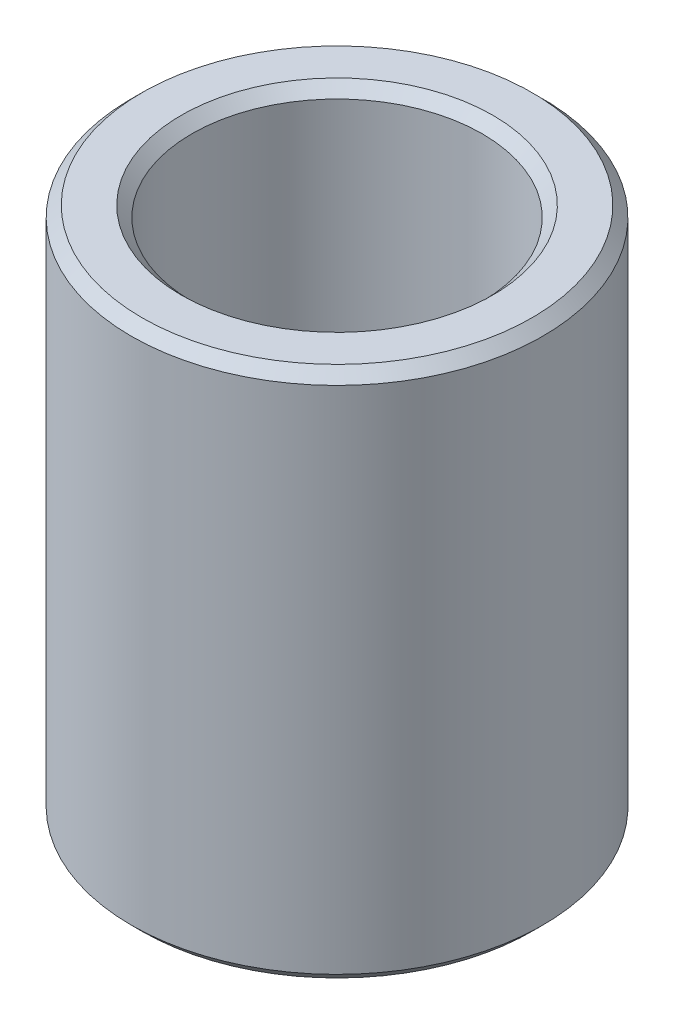
ISO-10303-21;
HEADER;
FILE_DESCRIPTION(('STEP AP214'),'2;1');
FILE_NAME('part.step','',(''),(''),'','','');
FILE_SCHEMA(('AUTOMOTIVE_DESIGN { 1 0 10303 214 1 1 1 1 }'));
ENDSEC;
DATA;
#1=APPLICATION_CONTEXT('core data for automotive mechanical design processes');
#2=APPLICATION_PROTOCOL_DEFINITION('international standard','automotive_design',2000,#1);
#3=PRODUCT_CONTEXT('',#1,'mechanical');
#4=PRODUCT('Part','Part','',(#3));
#5=PRODUCT_RELATED_PRODUCT_CATEGORY('part','',(#4));
#6=PRODUCT_DEFINITION_FORMATION('','',#4);
#7=PRODUCT_DEFINITION_CONTEXT('part definition',#1,'design');
#8=PRODUCT_DEFINITION('design','',#6,#7);
#9=PRODUCT_DEFINITION_SHAPE('','',#8);
#10=(LENGTH_UNIT() NAMED_UNIT(*) SI_UNIT(.MILLI.,.METRE.));
#11=(NAMED_UNIT(*) PLANE_ANGLE_UNIT() SI_UNIT($,.RADIAN.));
#12=(NAMED_UNIT(*) SI_UNIT($,.STERADIAN.) SOLID_ANGLE_UNIT());
#13=UNCERTAINTY_MEASURE_WITH_UNIT(LENGTH_MEASURE(1.E-05),#10,'distance_accuracy_value','');
#14=(GEOMETRIC_REPRESENTATION_CONTEXT(3) GLOBAL_UNCERTAINTY_ASSIGNED_CONTEXT((#13)) GLOBAL_UNIT_ASSIGNED_CONTEXT((#10,
#11,#12)) REPRESENTATION_CONTEXT('',''));
#15=CARTESIAN_POINT('',(0.,0.,0.));
#16=DIRECTION('',(0.,0.,1.));
#17=DIRECTION('',(1.,0.,0.));
#18=AXIS2_PLACEMENT_3D('',#15,#16,#17);
#19=CARTESIAN_POINT('',(0.,116.250073126259,0.));
#20=DIRECTION('',(0.,-1.,0.));
#21=DIRECTION('',(0.,0.,-1.));
#22=AXIS2_PLACEMENT_3D('',#19,#20,#21);
#23=CYLINDRICAL_SURFACE('',#22,45.);
#24=CARTESIAN_POINT('',(0.,2.33445178783528,0.));
#25=DIRECTION('',(0.,1.,0.));
#26=DIRECTION('',(0.,0.,1.));
#27=AXIS2_PLACEMENT_3D('',#24,#25,#26);
#28=CIRCLE('',#27,45.);
#29=CARTESIAN_POINT('',(0.,2.33445178783528,45.));
#30=VERTEX_POINT('',#29);
#31=EDGE_CURVE('E10',#30,#30,#28,.T.);
#32=ORIENTED_EDGE('',*,*,#31,.T.);
#33=EDGE_LOOP('',(#32));
#34=FACE_BOUND('',#33,.T.);
#35=CARTESIAN_POINT('',(0.,113.915621338424,0.));
#36=DIRECTION('',(0.,1.,0.));
#37=DIRECTION('',(0.,0.,1.));
#38=AXIS2_PLACEMENT_3D('',#35,#36,#37);
#39=CIRCLE('',#38,45.);
#40=CARTESIAN_POINT('',(0.,113.915621338424,45.));
#41=VERTEX_POINT('',#40);
#42=EDGE_CURVE('E50',#41,#41,#39,.F.);
#43=ORIENTED_EDGE('',*,*,#42,.T.);
#44=EDGE_LOOP('',(#43));
#45=FACE_BOUND('',#44,.T.);
#46=ADVANCED_FACE('F39',(#34,#45),#23,.T.);
#47=CARTESIAN_POINT('',(0.,116.250073126259,0.));
#48=DIRECTION('',(0.,1.,0.));
#49=DIRECTION('',(0.,0.,1.));
#50=AXIS2_PLACEMENT_3D('',#47,#48,#49);
#51=PLANE('',#50);
#52=CARTESIAN_POINT('',(0.,116.250073126259,0.));
#53=DIRECTION('',(0.,1.,0.));
#54=DIRECTION('',(0.,0.,1.));
#55=AXIS2_PLACEMENT_3D('',#52,#53,#54);
#56=CIRCLE('',#55,34.0833530824229);
#57=CARTESIAN_POINT('',(0.,116.250073126259,34.0833530824229));
#58=VERTEX_POINT('',#57);
#59=EDGE_CURVE('E58',#58,#58,#56,.F.);
#60=ORIENTED_EDGE('',*,*,#59,.T.);
#61=EDGE_LOOP('',(#60));
#62=FACE_BOUND('',#61,.T.);
#63=CARTESIAN_POINT('',(0.,116.250073126259,0.));
#64=DIRECTION('',(0.,1.,0.));
#65=DIRECTION('',(0.,0.,1.));
#66=AXIS2_PLACEMENT_3D('',#63,#64,#65);
#67=CIRCLE('',#66,42.6655482121647);
#68=CARTESIAN_POINT('',(0.,116.250073126259,42.6655482121647));
#69=VERTEX_POINT('',#68);
#70=EDGE_CURVE('E61',#69,#69,#67,.T.);
#71=ORIENTED_EDGE('',*,*,#70,.T.);
#72=EDGE_LOOP('',(#71));
#73=FACE_BOUND('',#72,.T.);
#74=ADVANCED_FACE('F88',(#62,#73),#51,.T.);
#75=CARTESIAN_POINT('',(0.,0.,0.));
#76=DIRECTION('',(0.,1.,0.));
#77=DIRECTION('',(0.,0.,1.));
#78=AXIS2_PLACEMENT_3D('',#75,#76,#77);
#79=PLANE('',#78);
#80=CARTESIAN_POINT('',(0.,0.,0.));
#81=DIRECTION('',(0.,1.,0.));
#82=DIRECTION('',(0.,0.,1.));
#83=AXIS2_PLACEMENT_3D('',#80,#81,#82);
#84=CIRCLE('',#83,34.0833530824229);
#85=CARTESIAN_POINT('',(0.,0.,34.0833530824229));
#86=VERTEX_POINT('',#85);
#87=EDGE_CURVE('E51',#86,#86,#84,.T.);
#88=ORIENTED_EDGE('',*,*,#87,.T.);
#89=EDGE_LOOP('',(#88));
#90=FACE_BOUND('',#89,.T.);
#91=CARTESIAN_POINT('',(0.,0.,0.));
#92=DIRECTION('',(0.,1.,0.));
#93=DIRECTION('',(0.,0.,1.));
#94=AXIS2_PLACEMENT_3D('',#91,#92,#93);
#95=CIRCLE('',#94,42.6655482121647);
#96=CARTESIAN_POINT('',(0.,0.,42.6655482121647));
#97=VERTEX_POINT('',#96);
#98=EDGE_CURVE('E54',#97,#97,#95,.F.);
#99=ORIENTED_EDGE('',*,*,#98,.T.);
#100=EDGE_LOOP('',(#99));
#101=FACE_BOUND('',#100,.T.);
#102=ADVANCED_FACE('F83',(#90,#101),#79,.F.);
#103=CARTESIAN_POINT('',(0.,116.250073126259,0.));
#104=DIRECTION('',(0.,-1.,0.));
#105=DIRECTION('',(0.,0.,-1.));
#106=AXIS2_PLACEMENT_3D('',#103,#104,#105);
#107=CYLINDRICAL_SURFACE('',#106,31.7489012945876);
#108=CARTESIAN_POINT('',(0.,113.915621338424,0.));
#109=DIRECTION('',(0.,1.,0.));
#110=DIRECTION('',(0.,0.,1.));
#111=AXIS2_PLACEMENT_3D('',#108,#109,#110);
#112=CIRCLE('',#111,31.7489012945876);
#113=CARTESIAN_POINT('',(0.,113.915621338424,31.7489012945876));
#114=VERTEX_POINT('',#113);
#115=EDGE_CURVE('E67',#114,#114,#112,.T.);
#116=ORIENTED_EDGE('',*,*,#115,.T.);
#117=EDGE_LOOP('',(#116));
#118=FACE_BOUND('',#117,.T.);
#119=CARTESIAN_POINT('',(0.,2.33445178783533,0.));
#120=DIRECTION('',(0.,1.,0.));
#121=DIRECTION('',(0.,0.,1.));
#122=AXIS2_PLACEMENT_3D('',#119,#120,#121);
#123=CIRCLE('',#122,31.7489012945876);
#124=CARTESIAN_POINT('',(0.,2.33445178783533,31.7489012945876));
#125=VERTEX_POINT('',#124);
#126=EDGE_CURVE('E69',#125,#125,#123,.F.);
#127=ORIENTED_EDGE('',*,*,#126,.T.);
#128=EDGE_LOOP('',(#127));
#129=FACE_BOUND('',#128,.T.);
#130=ADVANCED_FACE('F71',(#118,#129),#107,.F.);
#131=CARTESIAN_POINT('',(0.,113.915621338424,0.));
#132=DIRECTION('',(0.,1.,0.));
#133=DIRECTION('',(0.,0.,1.));
#134=AXIS2_PLACEMENT_3D('',#131,#132,#133);
#135=CONICAL_SURFACE('',#134,31.7489012945876,0.785398163397456);
#136=ORIENTED_EDGE('',*,*,#59,.F.);
#137=EDGE_LOOP('',(#136));
#138=FACE_BOUND('',#137,.T.);
#139=ORIENTED_EDGE('',*,*,#115,.F.);
#140=EDGE_LOOP('',(#139));
#141=FACE_BOUND('',#140,.T.);
#142=ADVANCED_FACE('F77',(#138,#141),#135,.F.);
#143=CARTESIAN_POINT('',(0.,0.,0.));
#144=DIRECTION('',(0.,-1.,0.));
#145=DIRECTION('',(0.,0.,-1.));
#146=AXIS2_PLACEMENT_3D('',#143,#144,#145);
#147=CONICAL_SURFACE('',#146,34.0833530824229,0.785398163397444);
#148=ORIENTED_EDGE('',*,*,#126,.F.);
#149=EDGE_LOOP('',(#148));
#150=FACE_BOUND('',#149,.T.);
#151=ORIENTED_EDGE('',*,*,#87,.F.);
#152=EDGE_LOOP('',(#151));
#153=FACE_BOUND('',#152,.T.);
#154=ADVANCED_FACE('F73',(#150,#153),#147,.F.);
#155=CARTESIAN_POINT('',(0.,2.33445178783528,0.));
#156=DIRECTION('',(0.,1.,0.));
#157=DIRECTION('',(0.,0.,1.));
#158=AXIS2_PLACEMENT_3D('',#155,#156,#157);
#159=CONICAL_SURFACE('',#158,45.,0.785398163397451);
#160=ORIENTED_EDGE('',*,*,#98,.F.);
#161=EDGE_LOOP('',(#160));
#162=FACE_BOUND('',#161,.T.);
#163=ORIENTED_EDGE('',*,*,#31,.F.);
#164=EDGE_LOOP('',(#163));
#165=FACE_BOUND('',#164,.T.);
#166=ADVANCED_FACE('F76',(#162,#165),#159,.T.);
#167=CARTESIAN_POINT('',(0.,116.250073126259,0.));
#168=DIRECTION('',(0.,-1.,0.));
#169=DIRECTION('',(0.,0.,-1.));
#170=AXIS2_PLACEMENT_3D('',#167,#168,#169);
#171=CONICAL_SURFACE('',#170,42.6655482121647,0.785398163397447);
#172=ORIENTED_EDGE('',*,*,#42,.F.);
#173=EDGE_LOOP('',(#172));
#174=FACE_BOUND('',#173,.T.);
#175=ORIENTED_EDGE('',*,*,#70,.F.);
#176=EDGE_LOOP('',(#175));
#177=FACE_BOUND('',#176,.T.);
#178=ADVANCED_FACE('F45',(#174,#177),#171,.T.);
#179=CLOSED_SHELL('',(#46,#74,#102,#130,#142,#154,#166,#178));
#180=MANIFOLD_SOLID_BREP('B2',#179);
#181=ADVANCED_BREP_SHAPE_REPRESENTATION('',(#18,#180),#14);
#182=SHAPE_DEFINITION_REPRESENTATION(#9,#181);
ENDSEC;
END-ISO-10303-21;
